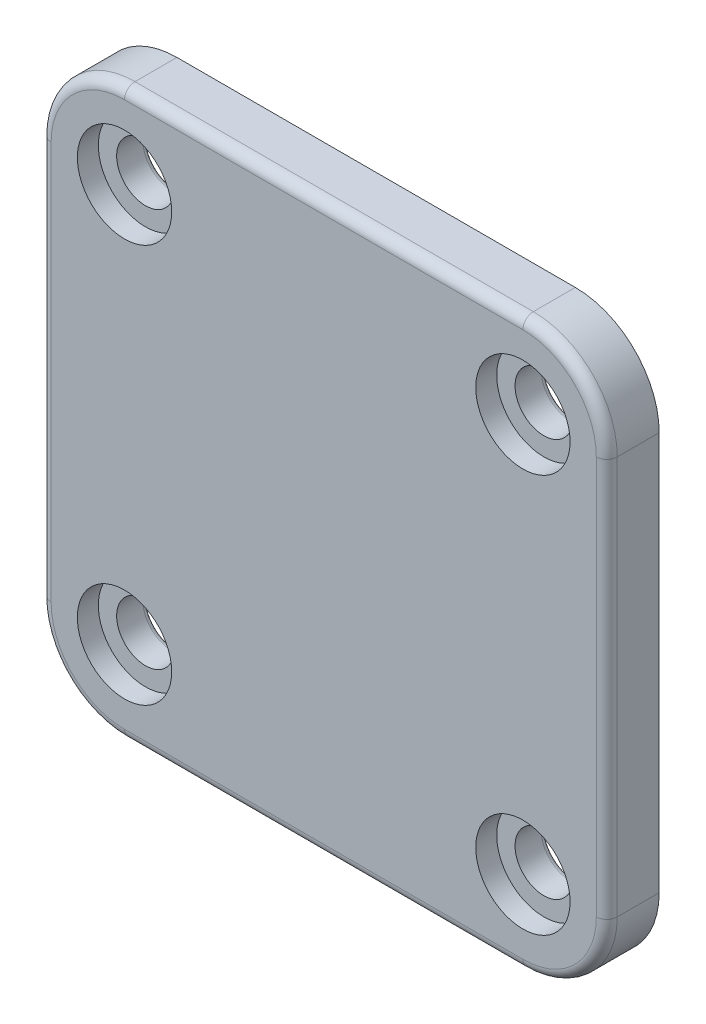
ISO-10303-21;
HEADER;
FILE_DESCRIPTION(('STEP AP214'),'2;1');
FILE_NAME('part.step','',(''),(''),'','','');
FILE_SCHEMA(('AUTOMOTIVE_DESIGN { 1 0 10303 214 1 1 1 1 }'));
ENDSEC;
DATA;
#1=APPLICATION_CONTEXT('core data for automotive mechanical design processes');
#2=APPLICATION_PROTOCOL_DEFINITION('international standard','automotive_design',2000,#1);
#3=PRODUCT_CONTEXT('',#1,'mechanical');
#4=PRODUCT('Part','Part','',(#3));
#5=PRODUCT_RELATED_PRODUCT_CATEGORY('part','',(#4));
#6=PRODUCT_DEFINITION_FORMATION('','',#4);
#7=PRODUCT_DEFINITION_CONTEXT('part definition',#1,'design');
#8=PRODUCT_DEFINITION('design','',#6,#7);
#9=PRODUCT_DEFINITION_SHAPE('','',#8);
#10=(LENGTH_UNIT() NAMED_UNIT(*) SI_UNIT(.MILLI.,.METRE.));
#11=(NAMED_UNIT(*) PLANE_ANGLE_UNIT() SI_UNIT($,.RADIAN.));
#12=(NAMED_UNIT(*) SI_UNIT($,.STERADIAN.) SOLID_ANGLE_UNIT());
#13=UNCERTAINTY_MEASURE_WITH_UNIT(LENGTH_MEASURE(1.E-05),#10,'distance_accuracy_value','');
#14=(GEOMETRIC_REPRESENTATION_CONTEXT(3) GLOBAL_UNCERTAINTY_ASSIGNED_CONTEXT((#13)) GLOBAL_UNIT_ASSIGNED_CONTEXT((#10,
#11,#12)) REPRESENTATION_CONTEXT('',''));
#15=CARTESIAN_POINT('',(0.,0.,0.));
#16=DIRECTION('',(0.,0.,1.));
#17=DIRECTION('',(1.,0.,0.));
#18=AXIS2_PLACEMENT_3D('',#15,#16,#17);
#19=CARTESIAN_POINT('',(-19.,19.,5.));
#20=DIRECTION('',(0.,0.,-1.));
#21=DIRECTION('',(-1.,0.,0.));
#22=AXIS2_PLACEMENT_3D('',#19,#20,#21);
#23=CYLINDRICAL_SURFACE('',#22,2.75);
#24=CARTESIAN_POINT('',(-19.,19.,0.5));
#25=DIRECTION('',(0.,0.,1.));
#26=DIRECTION('',(1.,0.,0.));
#27=AXIS2_PLACEMENT_3D('',#24,#25,#26);
#28=CIRCLE('',#27,2.75);
#29=CARTESIAN_POINT('',(-16.25,19.,0.5));
#30=VERTEX_POINT('',#29);
#31=EDGE_CURVE('E211',#30,#30,#28,.F.);
#32=ORIENTED_EDGE('',*,*,#31,.T.);
#33=EDGE_LOOP('',(#32));
#34=FACE_BOUND('',#33,.T.);
#35=CARTESIAN_POINT('',(-19.,19.,3.));
#36=DIRECTION('',(0.,0.,1.));
#37=DIRECTION('',(1.,0.,0.));
#38=AXIS2_PLACEMENT_3D('',#35,#36,#37);
#39=CIRCLE('',#38,2.75);
#40=CARTESIAN_POINT('',(-16.25,19.,3.));
#41=VERTEX_POINT('',#40);
#42=EDGE_CURVE('E47',#41,#41,#39,.T.);
#43=ORIENTED_EDGE('',*,*,#42,.T.);
#44=EDGE_LOOP('',(#43));
#45=FACE_BOUND('',#44,.T.);
#46=ADVANCED_FACE('F43',(#34,#45),#23,.F.);
#47=CARTESIAN_POINT('',(19.,19.,5.));
#48=DIRECTION('',(0.,0.,-1.));
#49=DIRECTION('',(-1.,0.,0.));
#50=AXIS2_PLACEMENT_3D('',#47,#48,#49);
#51=CYLINDRICAL_SURFACE('',#50,2.75);
#52=CARTESIAN_POINT('',(19.,19.,0.5));
#53=DIRECTION('',(0.,0.,1.));
#54=DIRECTION('',(1.,0.,0.));
#55=AXIS2_PLACEMENT_3D('',#52,#53,#54);
#56=CIRCLE('',#55,2.75);
#57=CARTESIAN_POINT('',(21.75,19.,0.5));
#58=VERTEX_POINT('',#57);
#59=EDGE_CURVE('E208',#58,#58,#56,.F.);
#60=ORIENTED_EDGE('',*,*,#59,.T.);
#61=EDGE_LOOP('',(#60));
#62=FACE_BOUND('',#61,.T.);
#63=CARTESIAN_POINT('',(19.,19.,3.));
#64=DIRECTION('',(0.,0.,1.));
#65=DIRECTION('',(1.,0.,0.));
#66=AXIS2_PLACEMENT_3D('',#63,#64,#65);
#67=CIRCLE('',#66,2.75);
#68=CARTESIAN_POINT('',(21.75,19.,3.));
#69=VERTEX_POINT('',#68);
#70=EDGE_CURVE('E269',#69,#69,#67,.T.);
#71=ORIENTED_EDGE('',*,*,#70,.T.);
#72=EDGE_LOOP('',(#71));
#73=FACE_BOUND('',#72,.T.);
#74=ADVANCED_FACE('F325',(#62,#73),#51,.F.);
#75=CARTESIAN_POINT('',(19.,-19.,5.));
#76=DIRECTION('',(0.,0.,-1.));
#77=DIRECTION('',(-1.,0.,0.));
#78=AXIS2_PLACEMENT_3D('',#75,#76,#77);
#79=CYLINDRICAL_SURFACE('',#78,2.75);
#80=CARTESIAN_POINT('',(19.,-19.,0.5));
#81=DIRECTION('',(0.,0.,1.));
#82=DIRECTION('',(1.,0.,0.));
#83=AXIS2_PLACEMENT_3D('',#80,#81,#82);
#84=CIRCLE('',#83,2.75);
#85=CARTESIAN_POINT('',(21.75,-19.,0.5));
#86=VERTEX_POINT('',#85);
#87=EDGE_CURVE('E205',#86,#86,#84,.F.);
#88=ORIENTED_EDGE('',*,*,#87,.T.);
#89=EDGE_LOOP('',(#88));
#90=FACE_BOUND('',#89,.T.);
#91=CARTESIAN_POINT('',(19.,-19.,3.));
#92=DIRECTION('',(0.,0.,1.));
#93=DIRECTION('',(1.,0.,0.));
#94=AXIS2_PLACEMENT_3D('',#91,#92,#93);
#95=CIRCLE('',#94,2.75);
#96=CARTESIAN_POINT('',(21.75,-19.,3.));
#97=VERTEX_POINT('',#96);
#98=EDGE_CURVE('E267',#97,#97,#95,.T.);
#99=ORIENTED_EDGE('',*,*,#98,.T.);
#100=EDGE_LOOP('',(#99));
#101=FACE_BOUND('',#100,.T.);
#102=ADVANCED_FACE('F332',(#90,#101),#79,.F.);
#103=CARTESIAN_POINT('',(-19.,-19.,5.));
#104=DIRECTION('',(0.,0.,-1.));
#105=DIRECTION('',(-1.,0.,0.));
#106=AXIS2_PLACEMENT_3D('',#103,#104,#105);
#107=CYLINDRICAL_SURFACE('',#106,2.75);
#108=CARTESIAN_POINT('',(-19.,-19.,0.5));
#109=DIRECTION('',(0.,0.,1.));
#110=DIRECTION('',(1.,0.,0.));
#111=AXIS2_PLACEMENT_3D('',#108,#109,#110);
#112=CIRCLE('',#111,2.75);
#113=CARTESIAN_POINT('',(-16.25,-19.,0.5));
#114=VERTEX_POINT('',#113);
#115=EDGE_CURVE('E214',#114,#114,#112,.F.);
#116=ORIENTED_EDGE('',*,*,#115,.T.);
#117=EDGE_LOOP('',(#116));
#118=FACE_BOUND('',#117,.T.);
#119=CARTESIAN_POINT('',(-19.,-19.,3.));
#120=DIRECTION('',(0.,0.,1.));
#121=DIRECTION('',(1.,0.,0.));
#122=AXIS2_PLACEMENT_3D('',#119,#120,#121);
#123=CIRCLE('',#122,2.75);
#124=CARTESIAN_POINT('',(-16.25,-19.,3.));
#125=VERTEX_POINT('',#124);
#126=EDGE_CURVE('E264',#125,#125,#123,.T.);
#127=ORIENTED_EDGE('',*,*,#126,.T.);
#128=EDGE_LOOP('',(#127));
#129=FACE_BOUND('',#128,.T.);
#130=ADVANCED_FACE('F340',(#118,#129),#107,.F.);
#131=CARTESIAN_POINT('',(0.,0.,5.));
#132=DIRECTION('',(0.,0.,1.));
#133=DIRECTION('',(1.,0.,0.));
#134=AXIS2_PLACEMENT_3D('',#131,#132,#133);
#135=PLANE('',#134);
#136=CARTESIAN_POINT('',(-19.,-19.,5.));
#137=DIRECTION('',(0.,0.,1.));
#138=DIRECTION('',(1.,0.,0.));
#139=AXIS2_PLACEMENT_3D('',#136,#137,#138);
#140=CIRCLE('',#139,4.5);
#141=CARTESIAN_POINT('',(-14.5,-19.,5.));
#142=VERTEX_POINT('',#141);
#143=EDGE_CURVE('E294',#142,#142,#140,.T.);
#144=ORIENTED_EDGE('',*,*,#143,.F.);
#145=EDGE_LOOP('',(#144));
#146=FACE_BOUND('',#145,.T.);
#147=CARTESIAN_POINT('',(19.,-19.,5.));
#148=DIRECTION('',(0.,0.,1.));
#149=DIRECTION('',(1.,0.,0.));
#150=AXIS2_PLACEMENT_3D('',#147,#148,#149);
#151=CIRCLE('',#150,4.5);
#152=CARTESIAN_POINT('',(23.5,-19.,5.));
#153=VERTEX_POINT('',#152);
#154=EDGE_CURVE('E301',#153,#153,#151,.T.);
#155=ORIENTED_EDGE('',*,*,#154,.F.);
#156=EDGE_LOOP('',(#155));
#157=FACE_BOUND('',#156,.T.);
#158=CARTESIAN_POINT('',(19.,19.,5.));
#159=DIRECTION('',(0.,0.,1.));
#160=DIRECTION('',(1.,0.,0.));
#161=AXIS2_PLACEMENT_3D('',#158,#159,#160);
#162=CIRCLE('',#161,4.5);
#163=CARTESIAN_POINT('',(23.5,19.,5.));
#164=VERTEX_POINT('',#163);
#165=EDGE_CURVE('E287',#164,#164,#162,.T.);
#166=ORIENTED_EDGE('',*,*,#165,.F.);
#167=EDGE_LOOP('',(#166));
#168=FACE_BOUND('',#167,.T.);
#169=CARTESIAN_POINT('',(-19.,19.,5.));
#170=DIRECTION('',(0.,0.,1.));
#171=DIRECTION('',(1.,0.,0.));
#172=AXIS2_PLACEMENT_3D('',#169,#170,#171);
#173=CIRCLE('',#172,4.5);
#174=CARTESIAN_POINT('',(-14.5,19.,5.));
#175=VERTEX_POINT('',#174);
#176=EDGE_CURVE('E285',#175,#175,#173,.T.);
#177=ORIENTED_EDGE('',*,*,#176,.F.);
#178=EDGE_LOOP('',(#177));
#179=FACE_BOUND('',#178,.T.);
#180=DIRECTION('',(-1.,0.,0.));
#181=VECTOR('',#180,1.);
#182=CARTESIAN_POINT('',(-19.,26.,5.));
#183=LINE('',#182,#181);
#184=CARTESIAN_POINT('',(19.,26.,5.));
#185=VERTEX_POINT('',#184);
#186=CARTESIAN_POINT('',(-19.,26.,5.));
#187=VERTEX_POINT('',#186);
#188=EDGE_CURVE('E229',#185,#187,#183,.T.);
#189=ORIENTED_EDGE('',*,*,#188,.T.);
#190=CARTESIAN_POINT('',(-19.,19.,5.));
#191=DIRECTION('',(0.,0.,1.));
#192=DIRECTION('',(1.,0.,0.));
#193=AXIS2_PLACEMENT_3D('',#190,#191,#192);
#194=CIRCLE('',#193,7.);
#195=CARTESIAN_POINT('',(-26.,19.,5.));
#196=VERTEX_POINT('',#195);
#197=EDGE_CURVE('E231',#187,#196,#194,.T.);
#198=ORIENTED_EDGE('',*,*,#197,.T.);
#199=DIRECTION('',(0.,-1.,0.));
#200=VECTOR('',#199,1.);
#201=CARTESIAN_POINT('',(-26.,-19.,5.));
#202=LINE('',#201,#200);
#203=CARTESIAN_POINT('',(-26.,-19.,5.));
#204=VERTEX_POINT('',#203);
#205=EDGE_CURVE('E217',#196,#204,#202,.T.);
#206=ORIENTED_EDGE('',*,*,#205,.T.);
#207=CARTESIAN_POINT('',(-19.,-19.,5.));
#208=DIRECTION('',(0.,0.,1.));
#209=DIRECTION('',(1.,0.,0.));
#210=AXIS2_PLACEMENT_3D('',#207,#208,#209);
#211=CIRCLE('',#210,7.);
#212=CARTESIAN_POINT('',(-19.,-26.,5.));
#213=VERTEX_POINT('',#212);
#214=EDGE_CURVE('E219',#204,#213,#211,.T.);
#215=ORIENTED_EDGE('',*,*,#214,.T.);
#216=DIRECTION('',(1.,0.,0.));
#217=VECTOR('',#216,1.);
#218=CARTESIAN_POINT('',(19.,-26.,5.));
#219=LINE('',#218,#217);
#220=CARTESIAN_POINT('',(19.,-26.,5.));
#221=VERTEX_POINT('',#220);
#222=EDGE_CURVE('E221',#213,#221,#219,.T.);
#223=ORIENTED_EDGE('',*,*,#222,.T.);
#224=CARTESIAN_POINT('',(19.,-19.,5.));
#225=DIRECTION('',(0.,0.,1.));
#226=DIRECTION('',(1.,0.,0.));
#227=AXIS2_PLACEMENT_3D('',#224,#225,#226);
#228=CIRCLE('',#227,7.);
#229=CARTESIAN_POINT('',(26.,-19.,5.));
#230=VERTEX_POINT('',#229);
#231=EDGE_CURVE('E223',#221,#230,#228,.T.);
#232=ORIENTED_EDGE('',*,*,#231,.T.);
#233=DIRECTION('',(0.,1.,0.));
#234=VECTOR('',#233,1.);
#235=CARTESIAN_POINT('',(26.,19.,5.));
#236=LINE('',#235,#234);
#237=CARTESIAN_POINT('',(26.,19.,5.));
#238=VERTEX_POINT('',#237);
#239=EDGE_CURVE('E225',#230,#238,#236,.T.);
#240=ORIENTED_EDGE('',*,*,#239,.T.);
#241=CARTESIAN_POINT('',(19.,19.,5.));
#242=DIRECTION('',(0.,0.,1.));
#243=DIRECTION('',(1.,0.,0.));
#244=AXIS2_PLACEMENT_3D('',#241,#242,#243);
#245=CIRCLE('',#244,7.);
#246=EDGE_CURVE('E227',#238,#185,#245,.T.);
#247=ORIENTED_EDGE('',*,*,#246,.T.);
#248=EDGE_LOOP('',(#189,#198,#206,#215,#223,#232,#240,#247));
#249=FACE_BOUND('',#248,.T.);
#250=ADVANCED_FACE('F337',(#146,#157,#168,#179,#249),#135,.T.);
#251=CARTESIAN_POINT('',(0.,0.,0.));
#252=DIRECTION('',(0.,0.,1.));
#253=DIRECTION('',(1.,0.,0.));
#254=AXIS2_PLACEMENT_3D('',#251,#252,#253);
#255=PLANE('',#254);
#256=CARTESIAN_POINT('',(19.,-19.,0.));
#257=DIRECTION('',(0.,0.,1.));
#258=DIRECTION('',(1.,0.,0.));
#259=AXIS2_PLACEMENT_3D('',#256,#257,#258);
#260=CIRCLE('',#259,3.25);
#261=CARTESIAN_POINT('',(22.25,-19.,0.));
#262=VERTEX_POINT('',#261);
#263=EDGE_CURVE('E202',#262,#262,#260,.T.);
#264=ORIENTED_EDGE('',*,*,#263,.T.);
#265=EDGE_LOOP('',(#264));
#266=FACE_BOUND('',#265,.T.);
#267=CARTESIAN_POINT('',(19.,19.,0.));
#268=DIRECTION('',(0.,0.,1.));
#269=DIRECTION('',(1.,0.,0.));
#270=AXIS2_PLACEMENT_3D('',#267,#268,#269);
#271=CIRCLE('',#270,3.25);
#272=CARTESIAN_POINT('',(22.25,19.,0.));
#273=VERTEX_POINT('',#272);
#274=EDGE_CURVE('E199',#273,#273,#271,.T.);
#275=ORIENTED_EDGE('',*,*,#274,.T.);
#276=EDGE_LOOP('',(#275));
#277=FACE_BOUND('',#276,.T.);
#278=CARTESIAN_POINT('',(-19.,19.,0.));
#279=DIRECTION('',(0.,0.,1.));
#280=DIRECTION('',(1.,0.,0.));
#281=AXIS2_PLACEMENT_3D('',#278,#279,#280);
#282=CIRCLE('',#281,3.25);
#283=CARTESIAN_POINT('',(-15.75,19.,0.));
#284=VERTEX_POINT('',#283);
#285=EDGE_CURVE('E196',#284,#284,#282,.T.);
#286=ORIENTED_EDGE('',*,*,#285,.T.);
#287=EDGE_LOOP('',(#286));
#288=FACE_BOUND('',#287,.T.);
#289=CARTESIAN_POINT('',(-19.,-19.,0.));
#290=DIRECTION('',(0.,0.,1.));
#291=DIRECTION('',(1.,0.,0.));
#292=AXIS2_PLACEMENT_3D('',#289,#290,#291);
#293=CIRCLE('',#292,3.25);
#294=CARTESIAN_POINT('',(-15.75,-19.,0.));
#295=VERTEX_POINT('',#294);
#296=EDGE_CURVE('E193',#295,#295,#293,.T.);
#297=ORIENTED_EDGE('',*,*,#296,.T.);
#298=EDGE_LOOP('',(#297));
#299=FACE_BOUND('',#298,.T.);
#300=DIRECTION('',(0.,-1.,0.));
#301=VECTOR('',#300,1.);
#302=CARTESIAN_POINT('',(-27.,-27.,0.));
#303=LINE('',#302,#301);
#304=CARTESIAN_POINT('',(-27.,19.,0.));
#305=VERTEX_POINT('',#304);
#306=CARTESIAN_POINT('',(-27.,-19.,0.));
#307=VERTEX_POINT('',#306);
#308=EDGE_CURVE('E138',#305,#307,#303,.T.);
#309=ORIENTED_EDGE('',*,*,#308,.F.);
#310=CARTESIAN_POINT('',(-19.,19.,0.));
#311=DIRECTION('',(0.,0.,1.));
#312=DIRECTION('',(1.,0.,0.));
#313=AXIS2_PLACEMENT_3D('',#310,#311,#312);
#314=CIRCLE('',#313,8.);
#315=CARTESIAN_POINT('',(-19.,27.,0.));
#316=VERTEX_POINT('',#315);
#317=EDGE_CURVE('E147',#305,#316,#314,.F.);
#318=ORIENTED_EDGE('',*,*,#317,.T.);
#319=DIRECTION('',(-1.,0.,0.));
#320=VECTOR('',#319,1.);
#321=CARTESIAN_POINT('',(27.,27.,0.));
#322=LINE('',#321,#320);
#323=CARTESIAN_POINT('',(19.,27.,0.));
#324=VERTEX_POINT('',#323);
#325=EDGE_CURVE('E176',#324,#316,#322,.T.);
#326=ORIENTED_EDGE('',*,*,#325,.F.);
#327=CARTESIAN_POINT('',(19.,19.,0.));
#328=DIRECTION('',(0.,0.,1.));
#329=DIRECTION('',(1.,0.,0.));
#330=AXIS2_PLACEMENT_3D('',#327,#328,#329);
#331=CIRCLE('',#330,8.);
#332=CARTESIAN_POINT('',(27.,19.,0.));
#333=VERTEX_POINT('',#332);
#334=EDGE_CURVE('E143',#324,#333,#331,.F.);
#335=ORIENTED_EDGE('',*,*,#334,.T.);
#336=DIRECTION('',(0.,1.,0.));
#337=VECTOR('',#336,1.);
#338=CARTESIAN_POINT('',(27.,-27.,0.));
#339=LINE('',#338,#337);
#340=CARTESIAN_POINT('',(27.,-19.,0.));
#341=VERTEX_POINT('',#340);
#342=EDGE_CURVE('E165',#341,#333,#339,.T.);
#343=ORIENTED_EDGE('',*,*,#342,.F.);
#344=CARTESIAN_POINT('',(19.,-19.,0.));
#345=DIRECTION('',(0.,0.,1.));
#346=DIRECTION('',(1.,0.,0.));
#347=AXIS2_PLACEMENT_3D('',#344,#345,#346);
#348=CIRCLE('',#347,8.);
#349=CARTESIAN_POINT('',(19.,-27.,0.));
#350=VERTEX_POINT('',#349);
#351=EDGE_CURVE('E155',#341,#350,#348,.F.);
#352=ORIENTED_EDGE('',*,*,#351,.T.);
#353=DIRECTION('',(1.,0.,0.));
#354=VECTOR('',#353,1.);
#355=CARTESIAN_POINT('',(27.,-27.,0.));
#356=LINE('',#355,#354);
#357=CARTESIAN_POINT('',(-19.,-27.,0.));
#358=VERTEX_POINT('',#357);
#359=EDGE_CURVE('E161',#358,#350,#356,.T.);
#360=ORIENTED_EDGE('',*,*,#359,.F.);
#361=CARTESIAN_POINT('',(-19.,-19.,0.));
#362=DIRECTION('',(0.,0.,1.));
#363=DIRECTION('',(1.,0.,0.));
#364=AXIS2_PLACEMENT_3D('',#361,#362,#363);
#365=CIRCLE('',#364,8.);
#366=EDGE_CURVE('E160',#358,#307,#365,.F.);
#367=ORIENTED_EDGE('',*,*,#366,.T.);
#368=EDGE_LOOP('',(#309,#318,#326,#335,#343,#352,#360,#367));
#369=FACE_BOUND('',#368,.T.);
#370=ADVANCED_FACE('F157',(#266,#277,#288,#299,#369),#255,.F.);
#371=CARTESIAN_POINT('',(-27.,-27.,5.));
#372=DIRECTION('',(1.,0.,0.));
#373=DIRECTION('',(0.,0.,-1.));
#374=AXIS2_PLACEMENT_3D('',#371,#372,#373);
#375=PLANE('',#374);
#376=DIRECTION('',(0.,0.,-1.));
#377=VECTOR('',#376,1.);
#378=CARTESIAN_POINT('',(-27.,-19.,5.));
#379=LINE('',#378,#377);
#380=CARTESIAN_POINT('',(-27.,-19.,4.));
#381=VERTEX_POINT('',#380);
#382=EDGE_CURVE('E144',#307,#381,#379,.F.);
#383=ORIENTED_EDGE('',*,*,#382,.T.);
#384=DIRECTION('',(0.,-1.,0.));
#385=VECTOR('',#384,1.);
#386=CARTESIAN_POINT('',(-27.,19.,4.));
#387=LINE('',#386,#385);
#388=CARTESIAN_POINT('',(-27.,19.,4.));
#389=VERTEX_POINT('',#388);
#390=EDGE_CURVE('E12',#381,#389,#387,.F.);
#391=ORIENTED_EDGE('',*,*,#390,.T.);
#392=DIRECTION('',(0.,0.,-1.));
#393=VECTOR('',#392,1.);
#394=CARTESIAN_POINT('',(-27.,19.,5.));
#395=LINE('',#394,#393);
#396=EDGE_CURVE('E134',#389,#305,#395,.T.);
#397=ORIENTED_EDGE('',*,*,#396,.T.);
#398=ORIENTED_EDGE('',*,*,#308,.T.);
#399=EDGE_LOOP('',(#383,#391,#397,#398));
#400=FACE_BOUND('',#399,.T.);
#401=ADVANCED_FACE('F136',(#400),#375,.F.);
#402=CARTESIAN_POINT('',(27.,-27.,5.));
#403=DIRECTION('',(0.,1.,0.));
#404=DIRECTION('',(0.,0.,1.));
#405=AXIS2_PLACEMENT_3D('',#402,#403,#404);
#406=PLANE('',#405);
#407=DIRECTION('',(0.,0.,-1.));
#408=VECTOR('',#407,1.);
#409=CARTESIAN_POINT('',(19.,-27.,5.));
#410=LINE('',#409,#408);
#411=CARTESIAN_POINT('',(19.,-27.,4.));
#412=VERTEX_POINT('',#411);
#413=EDGE_CURVE('E191',#350,#412,#410,.F.);
#414=ORIENTED_EDGE('',*,*,#413,.T.);
#415=DIRECTION('',(1.,0.,0.));
#416=VECTOR('',#415,1.);
#417=CARTESIAN_POINT('',(-19.,-27.,4.));
#418=LINE('',#417,#416);
#419=CARTESIAN_POINT('',(-19.,-27.,4.));
#420=VERTEX_POINT('',#419);
#421=EDGE_CURVE('E67',#412,#420,#418,.F.);
#422=ORIENTED_EDGE('',*,*,#421,.T.);
#423=DIRECTION('',(0.,0.,-1.));
#424=VECTOR('',#423,1.);
#425=CARTESIAN_POINT('',(-19.,-27.,5.));
#426=LINE('',#425,#424);
#427=EDGE_CURVE('E189',#420,#358,#426,.T.);
#428=ORIENTED_EDGE('',*,*,#427,.T.);
#429=ORIENTED_EDGE('',*,*,#359,.T.);
#430=EDGE_LOOP('',(#414,#422,#428,#429));
#431=FACE_BOUND('',#430,.T.);
#432=ADVANCED_FACE('F352',(#431),#406,.F.);
#433=CARTESIAN_POINT('',(27.,-27.,5.));
#434=DIRECTION('',(-1.,0.,0.));
#435=DIRECTION('',(0.,0.,1.));
#436=AXIS2_PLACEMENT_3D('',#433,#434,#435);
#437=PLANE('',#436);
#438=DIRECTION('',(0.,0.,-1.));
#439=VECTOR('',#438,1.);
#440=CARTESIAN_POINT('',(27.,19.,5.));
#441=LINE('',#440,#439);
#442=CARTESIAN_POINT('',(27.,19.,4.));
#443=VERTEX_POINT('',#442);
#444=EDGE_CURVE('E184',#333,#443,#441,.F.);
#445=ORIENTED_EDGE('',*,*,#444,.T.);
#446=DIRECTION('',(0.,1.,0.));
#447=VECTOR('',#446,1.);
#448=CARTESIAN_POINT('',(27.,-19.,4.));
#449=LINE('',#448,#447);
#450=CARTESIAN_POINT('',(27.,-19.,4.));
#451=VERTEX_POINT('',#450);
#452=EDGE_CURVE('E240',#443,#451,#449,.F.);
#453=ORIENTED_EDGE('',*,*,#452,.T.);
#454=DIRECTION('',(0.,0.,-1.));
#455=VECTOR('',#454,1.);
#456=CARTESIAN_POINT('',(27.,-19.,5.));
#457=LINE('',#456,#455);
#458=EDGE_CURVE('E187',#451,#341,#457,.T.);
#459=ORIENTED_EDGE('',*,*,#458,.T.);
#460=ORIENTED_EDGE('',*,*,#342,.T.);
#461=EDGE_LOOP('',(#445,#453,#459,#460));
#462=FACE_BOUND('',#461,.T.);
#463=ADVANCED_FACE('F348',(#462),#437,.F.);
#464=CARTESIAN_POINT('',(27.,27.,5.));
#465=DIRECTION('',(0.,-1.,0.));
#466=DIRECTION('',(0.,0.,-1.));
#467=AXIS2_PLACEMENT_3D('',#464,#465,#466);
#468=PLANE('',#467);
#469=DIRECTION('',(0.,0.,-1.));
#470=VECTOR('',#469,1.);
#471=CARTESIAN_POINT('',(-19.,27.,5.));
#472=LINE('',#471,#470);
#473=CARTESIAN_POINT('',(-19.,27.,4.));
#474=VERTEX_POINT('',#473);
#475=EDGE_CURVE('E150',#316,#474,#472,.F.);
#476=ORIENTED_EDGE('',*,*,#475,.T.);
#477=DIRECTION('',(-1.,0.,0.));
#478=VECTOR('',#477,1.);
#479=CARTESIAN_POINT('',(19.,27.,4.));
#480=LINE('',#479,#478);
#481=CARTESIAN_POINT('',(19.,27.,4.));
#482=VERTEX_POINT('',#481);
#483=EDGE_CURVE('E236',#474,#482,#480,.F.);
#484=ORIENTED_EDGE('',*,*,#483,.T.);
#485=DIRECTION('',(0.,0.,-1.));
#486=VECTOR('',#485,1.);
#487=CARTESIAN_POINT('',(19.,27.,5.));
#488=LINE('',#487,#486);
#489=EDGE_CURVE('E154',#482,#324,#488,.T.);
#490=ORIENTED_EDGE('',*,*,#489,.T.);
#491=ORIENTED_EDGE('',*,*,#325,.T.);
#492=EDGE_LOOP('',(#476,#484,#490,#491));
#493=FACE_BOUND('',#492,.T.);
#494=ADVANCED_FACE('F345',(#493),#468,.F.);
#495=CARTESIAN_POINT('',(-19.,19.,5.));
#496=DIRECTION('',(0.,0.,-1.));
#497=DIRECTION('',(-1.,0.,0.));
#498=AXIS2_PLACEMENT_3D('',#495,#496,#497);
#499=CYLINDRICAL_SURFACE('',#498,8.);
#500=ORIENTED_EDGE('',*,*,#396,.F.);
#501=CARTESIAN_POINT('',(-19.,19.,4.));
#502=DIRECTION('',(0.,0.,1.));
#503=DIRECTION('',(1.,0.,0.));
#504=AXIS2_PLACEMENT_3D('',#501,#502,#503);
#505=CIRCLE('',#504,8.);
#506=EDGE_CURVE('E234',#389,#474,#505,.F.);
#507=ORIENTED_EDGE('',*,*,#506,.T.);
#508=ORIENTED_EDGE('',*,*,#475,.F.);
#509=ORIENTED_EDGE('',*,*,#317,.F.);
#510=EDGE_LOOP('',(#500,#507,#508,#509));
#511=FACE_BOUND('',#510,.T.);
#512=ADVANCED_FACE('F148',(#511),#499,.T.);
#513=CARTESIAN_POINT('',(19.,-19.,5.));
#514=DIRECTION('',(0.,0.,-1.));
#515=DIRECTION('',(-1.,0.,0.));
#516=AXIS2_PLACEMENT_3D('',#513,#514,#515);
#517=CYLINDRICAL_SURFACE('',#516,8.);
#518=ORIENTED_EDGE('',*,*,#458,.F.);
#519=CARTESIAN_POINT('',(19.,-19.,4.));
#520=DIRECTION('',(0.,0.,1.));
#521=DIRECTION('',(1.,0.,0.));
#522=AXIS2_PLACEMENT_3D('',#519,#520,#521);
#523=CIRCLE('',#522,8.);
#524=EDGE_CURVE('E242',#451,#412,#523,.F.);
#525=ORIENTED_EDGE('',*,*,#524,.T.);
#526=ORIENTED_EDGE('',*,*,#413,.F.);
#527=ORIENTED_EDGE('',*,*,#351,.F.);
#528=EDGE_LOOP('',(#518,#525,#526,#527));
#529=FACE_BOUND('',#528,.T.);
#530=ADVANCED_FACE('F360',(#529),#517,.T.);
#531=CARTESIAN_POINT('',(-19.,-19.,5.));
#532=DIRECTION('',(0.,0.,-1.));
#533=DIRECTION('',(-1.,0.,0.));
#534=AXIS2_PLACEMENT_3D('',#531,#532,#533);
#535=CYLINDRICAL_SURFACE('',#534,8.);
#536=ORIENTED_EDGE('',*,*,#427,.F.);
#537=CARTESIAN_POINT('',(-19.,-19.,4.));
#538=DIRECTION('',(0.,0.,1.));
#539=DIRECTION('',(1.,0.,0.));
#540=AXIS2_PLACEMENT_3D('',#537,#538,#539);
#541=CIRCLE('',#540,8.);
#542=EDGE_CURVE('E52',#420,#381,#541,.F.);
#543=ORIENTED_EDGE('',*,*,#542,.T.);
#544=ORIENTED_EDGE('',*,*,#382,.F.);
#545=ORIENTED_EDGE('',*,*,#366,.F.);
#546=EDGE_LOOP('',(#536,#543,#544,#545));
#547=FACE_BOUND('',#546,.T.);
#548=ADVANCED_FACE('F363',(#547),#535,.T.);
#549=CARTESIAN_POINT('',(19.,19.,5.));
#550=DIRECTION('',(0.,0.,-1.));
#551=DIRECTION('',(-1.,0.,0.));
#552=AXIS2_PLACEMENT_3D('',#549,#550,#551);
#553=CYLINDRICAL_SURFACE('',#552,8.);
#554=ORIENTED_EDGE('',*,*,#489,.F.);
#555=CARTESIAN_POINT('',(19.,19.,4.));
#556=DIRECTION('',(0.,0.,1.));
#557=DIRECTION('',(1.,0.,0.));
#558=AXIS2_PLACEMENT_3D('',#555,#556,#557);
#559=CIRCLE('',#558,8.);
#560=EDGE_CURVE('E238',#482,#443,#559,.F.);
#561=ORIENTED_EDGE('',*,*,#560,.T.);
#562=ORIENTED_EDGE('',*,*,#444,.F.);
#563=ORIENTED_EDGE('',*,*,#334,.F.);
#564=EDGE_LOOP('',(#554,#561,#562,#563));
#565=FACE_BOUND('',#564,.T.);
#566=ADVANCED_FACE('F367',(#565),#553,.T.);
#567=CARTESIAN_POINT('',(19.,-19.,0.5));
#568=DIRECTION('',(0.,0.,1.));
#569=DIRECTION('',(1.,0.,0.));
#570=AXIS2_PLACEMENT_3D('',#567,#568,#569);
#571=TOROIDAL_SURFACE('',#570,3.25,0.5);
#572=ORIENTED_EDGE('',*,*,#87,.F.);
#573=EDGE_LOOP('',(#572));
#574=FACE_BOUND('',#573,.T.);
#575=ORIENTED_EDGE('',*,*,#263,.F.);
#576=EDGE_LOOP('',(#575));
#577=FACE_BOUND('',#576,.T.);
#578=ADVANCED_FACE('F370',(#574,#577),#571,.T.);
#579=CARTESIAN_POINT('',(19.,19.,0.5));
#580=DIRECTION('',(0.,0.,1.));
#581=DIRECTION('',(1.,0.,0.));
#582=AXIS2_PLACEMENT_3D('',#579,#580,#581);
#583=TOROIDAL_SURFACE('',#582,3.25,0.5);
#584=ORIENTED_EDGE('',*,*,#59,.F.);
#585=EDGE_LOOP('',(#584));
#586=FACE_BOUND('',#585,.T.);
#587=ORIENTED_EDGE('',*,*,#274,.F.);
#588=EDGE_LOOP('',(#587));
#589=FACE_BOUND('',#588,.T.);
#590=ADVANCED_FACE('F374',(#586,#589),#583,.T.);
#591=CARTESIAN_POINT('',(-19.,19.,0.5));
#592=DIRECTION('',(0.,0.,1.));
#593=DIRECTION('',(1.,0.,0.));
#594=AXIS2_PLACEMENT_3D('',#591,#592,#593);
#595=TOROIDAL_SURFACE('',#594,3.25,0.5);
#596=ORIENTED_EDGE('',*,*,#31,.F.);
#597=EDGE_LOOP('',(#596));
#598=FACE_BOUND('',#597,.T.);
#599=ORIENTED_EDGE('',*,*,#285,.F.);
#600=EDGE_LOOP('',(#599));
#601=FACE_BOUND('',#600,.T.);
#602=ADVANCED_FACE('F378',(#598,#601),#595,.T.);
#603=CARTESIAN_POINT('',(-19.,-19.,0.5));
#604=DIRECTION('',(0.,0.,1.));
#605=DIRECTION('',(1.,0.,0.));
#606=AXIS2_PLACEMENT_3D('',#603,#604,#605);
#607=TOROIDAL_SURFACE('',#606,3.25,0.5);
#608=ORIENTED_EDGE('',*,*,#115,.F.);
#609=EDGE_LOOP('',(#608));
#610=FACE_BOUND('',#609,.T.);
#611=ORIENTED_EDGE('',*,*,#296,.F.);
#612=EDGE_LOOP('',(#611));
#613=FACE_BOUND('',#612,.T.);
#614=ADVANCED_FACE('F382',(#610,#613),#607,.T.);
#615=CARTESIAN_POINT('',(19.,-19.,4.));
#616=DIRECTION('',(0.,0.,1.));
#617=DIRECTION('',(1.,0.,0.));
#618=AXIS2_PLACEMENT_3D('',#615,#616,#617);
#619=TOROIDAL_SURFACE('',#618,7.,1.);
#620=CARTESIAN_POINT('',(19.,-26.,4.));
#621=DIRECTION('',(-1.,0.,0.));
#622=DIRECTION('',(0.,0.,1.));
#623=AXIS2_PLACEMENT_3D('',#620,#621,#622);
#624=CIRCLE('',#623,1.);
#625=EDGE_CURVE('E168',#412,#221,#624,.T.);
#626=ORIENTED_EDGE('',*,*,#625,.F.);
#627=ORIENTED_EDGE('',*,*,#524,.F.);
#628=CARTESIAN_POINT('',(26.,-19.,4.));
#629=DIRECTION('',(0.,1.,0.));
#630=DIRECTION('',(0.,0.,1.));
#631=AXIS2_PLACEMENT_3D('',#628,#629,#630);
#632=CIRCLE('',#631,1.);
#633=EDGE_CURVE('E162',#230,#451,#632,.T.);
#634=ORIENTED_EDGE('',*,*,#633,.F.);
#635=ORIENTED_EDGE('',*,*,#231,.F.);
#636=EDGE_LOOP('',(#626,#627,#634,#635));
#637=FACE_BOUND('',#636,.T.);
#638=ADVANCED_FACE('F45',(#637),#619,.T.);
#639=CARTESIAN_POINT('',(26.,0.,4.));
#640=DIRECTION('',(0.,-1.,0.));
#641=DIRECTION('',(0.,0.,-1.));
#642=AXIS2_PLACEMENT_3D('',#639,#640,#641);
#643=CYLINDRICAL_SURFACE('',#642,1.);
#644=ORIENTED_EDGE('',*,*,#633,.T.);
#645=ORIENTED_EDGE('',*,*,#452,.F.);
#646=CARTESIAN_POINT('',(26.,19.,4.));
#647=DIRECTION('',(0.,1.,0.));
#648=DIRECTION('',(0.,0.,1.));
#649=AXIS2_PLACEMENT_3D('',#646,#647,#648);
#650=CIRCLE('',#649,1.);
#651=EDGE_CURVE('E259',#238,#443,#650,.T.);
#652=ORIENTED_EDGE('',*,*,#651,.F.);
#653=ORIENTED_EDGE('',*,*,#239,.F.);
#654=EDGE_LOOP('',(#644,#645,#652,#653));
#655=FACE_BOUND('',#654,.T.);
#656=ADVANCED_FACE('F409',(#655),#643,.T.);
#657=CARTESIAN_POINT('',(0.,-26.,4.));
#658=DIRECTION('',(-1.,0.,0.));
#659=DIRECTION('',(0.,0.,1.));
#660=AXIS2_PLACEMENT_3D('',#657,#658,#659);
#661=CYLINDRICAL_SURFACE('',#660,1.);
#662=ORIENTED_EDGE('',*,*,#625,.T.);
#663=ORIENTED_EDGE('',*,*,#222,.F.);
#664=CARTESIAN_POINT('',(-19.,-26.,4.));
#665=DIRECTION('',(-1.,0.,0.));
#666=DIRECTION('',(0.,0.,1.));
#667=AXIS2_PLACEMENT_3D('',#664,#665,#666);
#668=CIRCLE('',#667,1.);
#669=EDGE_CURVE('E256',#420,#213,#668,.T.);
#670=ORIENTED_EDGE('',*,*,#669,.F.);
#671=ORIENTED_EDGE('',*,*,#421,.F.);
#672=EDGE_LOOP('',(#662,#663,#670,#671));
#673=FACE_BOUND('',#672,.T.);
#674=ADVANCED_FACE('F406',(#673),#661,.T.);
#675=CARTESIAN_POINT('',(19.,19.,4.));
#676=DIRECTION('',(0.,0.,1.));
#677=DIRECTION('',(1.,0.,0.));
#678=AXIS2_PLACEMENT_3D('',#675,#676,#677);
#679=TOROIDAL_SURFACE('',#678,7.,1.);
#680=ORIENTED_EDGE('',*,*,#651,.T.);
#681=ORIENTED_EDGE('',*,*,#560,.F.);
#682=CARTESIAN_POINT('',(19.,26.,4.));
#683=DIRECTION('',(-1.,0.,0.));
#684=DIRECTION('',(0.,0.,1.));
#685=AXIS2_PLACEMENT_3D('',#682,#683,#684);
#686=CIRCLE('',#685,1.);
#687=EDGE_CURVE('E253',#185,#482,#686,.T.);
#688=ORIENTED_EDGE('',*,*,#687,.F.);
#689=ORIENTED_EDGE('',*,*,#246,.F.);
#690=EDGE_LOOP('',(#680,#681,#688,#689));
#691=FACE_BOUND('',#690,.T.);
#692=ADVANCED_FACE('F402',(#691),#679,.T.);
#693=CARTESIAN_POINT('',(-19.,-19.,4.));
#694=DIRECTION('',(0.,0.,1.));
#695=DIRECTION('',(1.,0.,0.));
#696=AXIS2_PLACEMENT_3D('',#693,#694,#695);
#697=TOROIDAL_SURFACE('',#696,7.,1.);
#698=ORIENTED_EDGE('',*,*,#669,.T.);
#699=ORIENTED_EDGE('',*,*,#214,.F.);
#700=CARTESIAN_POINT('',(-26.,-19.,4.));
#701=DIRECTION('',(0.,1.,0.));
#702=DIRECTION('',(0.,0.,1.));
#703=AXIS2_PLACEMENT_3D('',#700,#701,#702);
#704=CIRCLE('',#703,1.);
#705=EDGE_CURVE('E250',#381,#204,#704,.T.);
#706=ORIENTED_EDGE('',*,*,#705,.F.);
#707=ORIENTED_EDGE('',*,*,#542,.F.);
#708=EDGE_LOOP('',(#698,#699,#706,#707));
#709=FACE_BOUND('',#708,.T.);
#710=ADVANCED_FACE('F398',(#709),#697,.T.);
#711=CARTESIAN_POINT('',(0.,26.,4.));
#712=DIRECTION('',(1.,0.,0.));
#713=DIRECTION('',(0.,0.,-1.));
#714=AXIS2_PLACEMENT_3D('',#711,#712,#713);
#715=CYLINDRICAL_SURFACE('',#714,1.);
#716=ORIENTED_EDGE('',*,*,#687,.T.);
#717=ORIENTED_EDGE('',*,*,#483,.F.);
#718=CARTESIAN_POINT('',(-19.,26.,4.));
#719=DIRECTION('',(-1.,0.,0.));
#720=DIRECTION('',(0.,0.,1.));
#721=AXIS2_PLACEMENT_3D('',#718,#719,#720);
#722=CIRCLE('',#721,1.);
#723=EDGE_CURVE('E248',#187,#474,#722,.T.);
#724=ORIENTED_EDGE('',*,*,#723,.F.);
#725=ORIENTED_EDGE('',*,*,#188,.F.);
#726=EDGE_LOOP('',(#716,#717,#724,#725));
#727=FACE_BOUND('',#726,.T.);
#728=ADVANCED_FACE('F394',(#727),#715,.T.);
#729=CARTESIAN_POINT('',(-26.,0.,4.));
#730=DIRECTION('',(0.,1.,0.));
#731=DIRECTION('',(0.,0.,1.));
#732=AXIS2_PLACEMENT_3D('',#729,#730,#731);
#733=CYLINDRICAL_SURFACE('',#732,1.);
#734=ORIENTED_EDGE('',*,*,#705,.T.);
#735=ORIENTED_EDGE('',*,*,#205,.F.);
#736=CARTESIAN_POINT('',(-26.,19.,4.));
#737=DIRECTION('',(0.,1.,0.));
#738=DIRECTION('',(0.,0.,1.));
#739=AXIS2_PLACEMENT_3D('',#736,#737,#738);
#740=CIRCLE('',#739,1.);
#741=EDGE_CURVE('E246',#389,#196,#740,.T.);
#742=ORIENTED_EDGE('',*,*,#741,.F.);
#743=ORIENTED_EDGE('',*,*,#390,.F.);
#744=EDGE_LOOP('',(#734,#735,#742,#743));
#745=FACE_BOUND('',#744,.T.);
#746=ADVANCED_FACE('F390',(#745),#733,.T.);
#747=CARTESIAN_POINT('',(-19.,19.,4.));
#748=DIRECTION('',(0.,0.,1.));
#749=DIRECTION('',(1.,0.,0.));
#750=AXIS2_PLACEMENT_3D('',#747,#748,#749);
#751=TOROIDAL_SURFACE('',#750,7.,1.);
#752=ORIENTED_EDGE('',*,*,#723,.T.);
#753=ORIENTED_EDGE('',*,*,#506,.F.);
#754=ORIENTED_EDGE('',*,*,#741,.T.);
#755=ORIENTED_EDGE('',*,*,#197,.F.);
#756=EDGE_LOOP('',(#752,#753,#754,#755));
#757=FACE_BOUND('',#756,.T.);
#758=ADVANCED_FACE('F387',(#757),#751,.T.);
#759=CARTESIAN_POINT('',(-19.,-19.,-12.7279220613579));
#760=DIRECTION('',(0.,0.,1.));
#761=DIRECTION('',(1.,0.,0.));
#762=AXIS2_PLACEMENT_3D('',#759,#760,#761);
#763=CYLINDRICAL_SURFACE('',#762,4.5);
#764=CARTESIAN_POINT('',(-19.,-19.,3.));
#765=DIRECTION('',(0.,0.,1.));
#766=DIRECTION('',(1.,0.,0.));
#767=AXIS2_PLACEMENT_3D('',#764,#765,#766);
#768=CIRCLE('',#767,4.5);
#769=CARTESIAN_POINT('',(-14.5,-19.,3.));
#770=VERTEX_POINT('',#769);
#771=EDGE_CURVE('E298',#770,#770,#768,.F.);
#772=ORIENTED_EDGE('',*,*,#771,.T.);
#773=EDGE_LOOP('',(#772));
#774=FACE_BOUND('',#773,.T.);
#775=ORIENTED_EDGE('',*,*,#143,.T.);
#776=EDGE_LOOP('',(#775));
#777=FACE_BOUND('',#776,.T.);
#778=ADVANCED_FACE('F389',(#774,#777),#763,.F.);
#779=CARTESIAN_POINT('',(0.,0.,3.));
#780=DIRECTION('',(0.,0.,1.));
#781=DIRECTION('',(1.,0.,0.));
#782=AXIS2_PLACEMENT_3D('',#779,#780,#781);
#783=PLANE('',#782);
#784=ORIENTED_EDGE('',*,*,#126,.F.);
#785=EDGE_LOOP('',(#784));
#786=FACE_BOUND('',#785,.T.);
#787=ORIENTED_EDGE('',*,*,#771,.F.);
#788=EDGE_LOOP('',(#787));
#789=FACE_BOUND('',#788,.T.);
#790=ADVANCED_FACE('F530',(#786,#789),#783,.T.);
#791=CARTESIAN_POINT('',(19.,-19.,-12.7279220613579));
#792=DIRECTION('',(0.,0.,1.));
#793=DIRECTION('',(1.,0.,0.));
#794=AXIS2_PLACEMENT_3D('',#791,#792,#793);
#795=CYLINDRICAL_SURFACE('',#794,4.5);
#796=CARTESIAN_POINT('',(19.,-19.,3.));
#797=DIRECTION('',(0.,0.,1.));
#798=DIRECTION('',(1.,0.,0.));
#799=AXIS2_PLACEMENT_3D('',#796,#797,#798);
#800=CIRCLE('',#799,4.5);
#801=CARTESIAN_POINT('',(23.5,-19.,3.));
#802=VERTEX_POINT('',#801);
#803=EDGE_CURVE('E297',#802,#802,#800,.F.);
#804=ORIENTED_EDGE('',*,*,#803,.T.);
#805=EDGE_LOOP('',(#804));
#806=FACE_BOUND('',#805,.T.);
#807=ORIENTED_EDGE('',*,*,#154,.T.);
#808=EDGE_LOOP('',(#807));
#809=FACE_BOUND('',#808,.T.);
#810=ADVANCED_FACE('F540',(#806,#809),#795,.F.);
#811=CARTESIAN_POINT('',(0.,0.,3.));
#812=DIRECTION('',(0.,0.,1.));
#813=DIRECTION('',(1.,0.,0.));
#814=AXIS2_PLACEMENT_3D('',#811,#812,#813);
#815=PLANE('',#814);
#816=ORIENTED_EDGE('',*,*,#98,.F.);
#817=EDGE_LOOP('',(#816));
#818=FACE_BOUND('',#817,.T.);
#819=ORIENTED_EDGE('',*,*,#803,.F.);
#820=EDGE_LOOP('',(#819));
#821=FACE_BOUND('',#820,.T.);
#822=ADVANCED_FACE('F321',(#818,#821),#815,.T.);
#823=CARTESIAN_POINT('',(19.,19.,-12.7279220613579));
#824=DIRECTION('',(0.,0.,1.));
#825=DIRECTION('',(1.,0.,0.));
#826=AXIS2_PLACEMENT_3D('',#823,#824,#825);
#827=CYLINDRICAL_SURFACE('',#826,4.5);
#828=CARTESIAN_POINT('',(19.,19.,3.));
#829=DIRECTION('',(0.,0.,1.));
#830=DIRECTION('',(1.,0.,0.));
#831=AXIS2_PLACEMENT_3D('',#828,#829,#830);
#832=CIRCLE('',#831,4.5);
#833=CARTESIAN_POINT('',(23.5,19.,3.));
#834=VERTEX_POINT('',#833);
#835=EDGE_CURVE('E291',#834,#834,#832,.F.);
#836=ORIENTED_EDGE('',*,*,#835,.T.);
#837=EDGE_LOOP('',(#836));
#838=FACE_BOUND('',#837,.T.);
#839=ORIENTED_EDGE('',*,*,#165,.T.);
#840=EDGE_LOOP('',(#839));
#841=FACE_BOUND('',#840,.T.);
#842=ADVANCED_FACE('F309',(#838,#841),#827,.F.);
#843=CARTESIAN_POINT('',(0.,0.,3.));
#844=DIRECTION('',(0.,0.,1.));
#845=DIRECTION('',(1.,0.,0.));
#846=AXIS2_PLACEMENT_3D('',#843,#844,#845);
#847=PLANE('',#846);
#848=ORIENTED_EDGE('',*,*,#70,.F.);
#849=EDGE_LOOP('',(#848));
#850=FACE_BOUND('',#849,.T.);
#851=ORIENTED_EDGE('',*,*,#835,.F.);
#852=EDGE_LOOP('',(#851));
#853=FACE_BOUND('',#852,.T.);
#854=ADVANCED_FACE('F312',(#850,#853),#847,.T.);
#855=CARTESIAN_POINT('',(-19.,19.,-12.7279220613579));
#856=DIRECTION('',(0.,0.,1.));
#857=DIRECTION('',(1.,0.,0.));
#858=AXIS2_PLACEMENT_3D('',#855,#856,#857);
#859=CYLINDRICAL_SURFACE('',#858,4.5);
#860=CARTESIAN_POINT('',(-19.,19.,3.));
#861=DIRECTION('',(0.,0.,1.));
#862=DIRECTION('',(1.,0.,0.));
#863=AXIS2_PLACEMENT_3D('',#860,#861,#862);
#864=CIRCLE('',#863,4.5);
#865=CARTESIAN_POINT('',(-14.5,19.,3.));
#866=VERTEX_POINT('',#865);
#867=EDGE_CURVE('E171',#866,#866,#864,.F.);
#868=ORIENTED_EDGE('',*,*,#867,.T.);
#869=EDGE_LOOP('',(#868));
#870=FACE_BOUND('',#869,.T.);
#871=ORIENTED_EDGE('',*,*,#176,.T.);
#872=EDGE_LOOP('',(#871));
#873=FACE_BOUND('',#872,.T.);
#874=ADVANCED_FACE('F280',(#870,#873),#859,.F.);
#875=CARTESIAN_POINT('',(0.,0.,3.));
#876=DIRECTION('',(0.,0.,1.));
#877=DIRECTION('',(1.,0.,0.));
#878=AXIS2_PLACEMENT_3D('',#875,#876,#877);
#879=PLANE('',#878);
#880=ORIENTED_EDGE('',*,*,#42,.F.);
#881=EDGE_LOOP('',(#880));
#882=FACE_BOUND('',#881,.T.);
#883=ORIENTED_EDGE('',*,*,#867,.F.);
#884=EDGE_LOOP('',(#883));
#885=FACE_BOUND('',#884,.T.);
#886=ADVANCED_FACE('F277',(#882,#885),#879,.T.);
#887=CLOSED_SHELL('',(#46,#74,#102,#130,#250,#370,#401,#432,#463,#494,#512,#530,#548,#566,#578,
#590,#602,#614,#638,#656,#674,#692,#710,#728,#746,#758,#778,#790,#810,#822,#842,#854,#874,#886));
#888=MANIFOLD_SOLID_BREP('B2',#887);
#889=ADVANCED_BREP_SHAPE_REPRESENTATION('',(#18,#888),#14);
#890=SHAPE_DEFINITION_REPRESENTATION(#9,#889);
ENDSEC;
END-ISO-10303-21;
